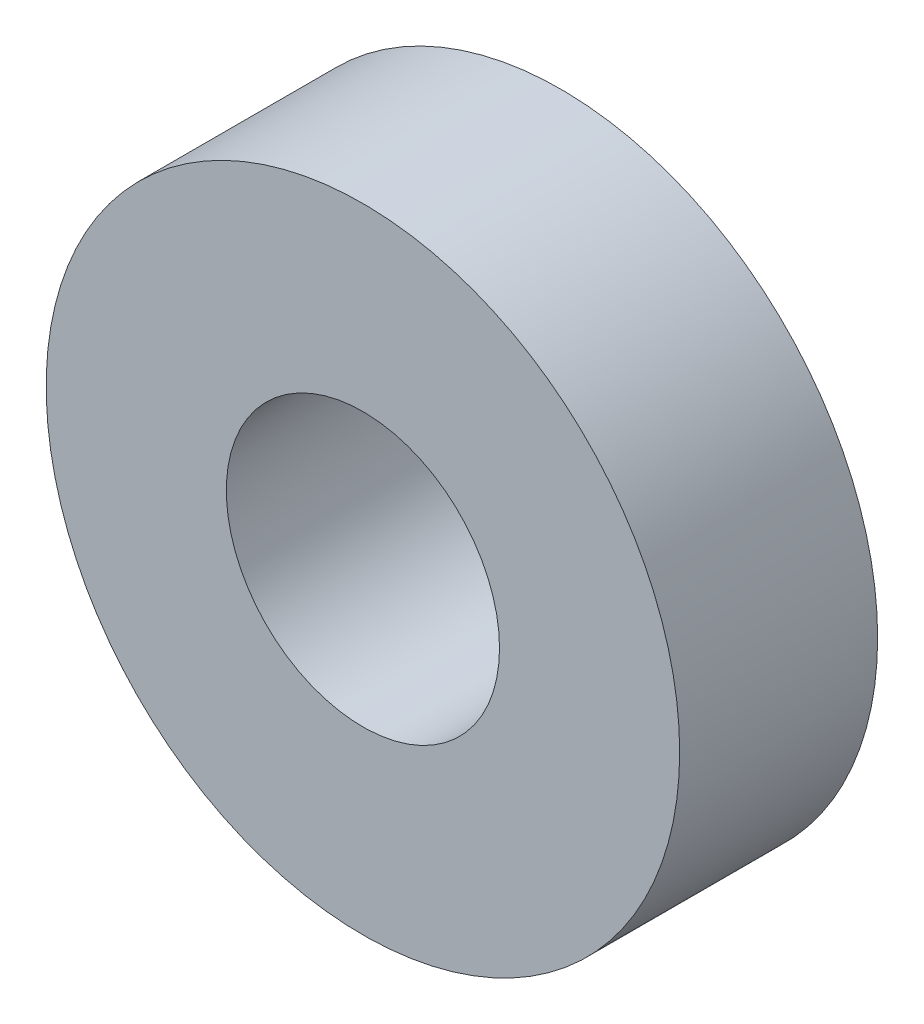
ISO-10303-21;
HEADER;
FILE_DESCRIPTION(('STEP AP214'),'2;1');
FILE_NAME('part.step','',(''),(''),'','','');
FILE_SCHEMA(('AUTOMOTIVE_DESIGN { 1 0 10303 214 1 1 1 1 }'));
ENDSEC;
DATA;
#1=APPLICATION_CONTEXT('core data for automotive mechanical design processes');
#2=APPLICATION_PROTOCOL_DEFINITION('international standard','automotive_design',2000,#1);
#3=PRODUCT_CONTEXT('',#1,'mechanical');
#4=PRODUCT('Part','Part','',(#3));
#5=PRODUCT_RELATED_PRODUCT_CATEGORY('part','',(#4));
#6=PRODUCT_DEFINITION_FORMATION('','',#4);
#7=PRODUCT_DEFINITION_CONTEXT('part definition',#1,'design');
#8=PRODUCT_DEFINITION('design','',#6,#7);
#9=PRODUCT_DEFINITION_SHAPE('','',#8);
#10=(LENGTH_UNIT() NAMED_UNIT(*) SI_UNIT(.MILLI.,.METRE.));
#11=(NAMED_UNIT(*) PLANE_ANGLE_UNIT() SI_UNIT($,.RADIAN.));
#12=(NAMED_UNIT(*) SI_UNIT($,.STERADIAN.) SOLID_ANGLE_UNIT());
#13=UNCERTAINTY_MEASURE_WITH_UNIT(LENGTH_MEASURE(1.E-05),#10,'distance_accuracy_value','');
#14=(GEOMETRIC_REPRESENTATION_CONTEXT(3) GLOBAL_UNCERTAINTY_ASSIGNED_CONTEXT((#13)) GLOBAL_UNIT_ASSIGNED_CONTEXT((#10,
#11,#12)) REPRESENTATION_CONTEXT('',''));
#15=CARTESIAN_POINT('',(0.,0.,0.));
#16=DIRECTION('',(0.,0.,1.));
#17=DIRECTION('',(1.,0.,0.));
#18=AXIS2_PLACEMENT_3D('',#15,#16,#17);
#19=CARTESIAN_POINT('',(0.,0.,2.5));
#20=DIRECTION('',(0.,0.,1.));
#21=DIRECTION('',(1.,0.,0.));
#22=AXIS2_PLACEMENT_3D('',#19,#20,#21);
#23=PLANE('',#22);
#24=CARTESIAN_POINT('',(0.,0.,2.5));
#25=DIRECTION('',(0.,0.,1.));
#26=DIRECTION('',(1.,0.,0.));
#27=AXIS2_PLACEMENT_3D('',#24,#25,#26);
#28=CIRCLE('',#27,4.);
#29=CARTESIAN_POINT('',(4.,0.,2.5));
#30=VERTEX_POINT('',#29);
#31=EDGE_CURVE('E10',#30,#30,#28,.T.);
#32=ORIENTED_EDGE('',*,*,#31,.T.);
#33=EDGE_LOOP('',(#32));
#34=FACE_BOUND('',#33,.T.);
#35=CARTESIAN_POINT('',(0.,0.,2.5));
#36=DIRECTION('',(0.,0.,1.));
#37=DIRECTION('',(1.,0.,0.));
#38=AXIS2_PLACEMENT_3D('',#35,#36,#37);
#39=CIRCLE('',#38,1.725);
#40=CARTESIAN_POINT('',(1.725,0.,2.5));
#41=VERTEX_POINT('',#40);
#42=EDGE_CURVE('E42',#41,#41,#39,.T.);
#43=ORIENTED_EDGE('',*,*,#42,.F.);
#44=EDGE_LOOP('',(#43));
#45=FACE_BOUND('',#44,.T.);
#46=ADVANCED_FACE('F31',(#34,#45),#23,.T.);
#47=CARTESIAN_POINT('',(0.,0.,0.));
#48=DIRECTION('',(0.,0.,1.));
#49=DIRECTION('',(1.,0.,0.));
#50=AXIS2_PLACEMENT_3D('',#47,#48,#49);
#51=PLANE('',#50);
#52=CARTESIAN_POINT('',(0.,0.,0.));
#53=DIRECTION('',(0.,0.,1.));
#54=DIRECTION('',(1.,0.,0.));
#55=AXIS2_PLACEMENT_3D('',#52,#53,#54);
#56=CIRCLE('',#55,4.);
#57=CARTESIAN_POINT('',(4.,0.,0.));
#58=VERTEX_POINT('',#57);
#59=EDGE_CURVE('E35',#58,#58,#56,.T.);
#60=ORIENTED_EDGE('',*,*,#59,.F.);
#61=EDGE_LOOP('',(#60));
#62=FACE_BOUND('',#61,.T.);
#63=CARTESIAN_POINT('',(0.,0.,0.));
#64=DIRECTION('',(0.,0.,1.));
#65=DIRECTION('',(1.,0.,0.));
#66=AXIS2_PLACEMENT_3D('',#63,#64,#65);
#67=CIRCLE('',#66,1.725);
#68=CARTESIAN_POINT('',(1.725,0.,0.));
#69=VERTEX_POINT('',#68);
#70=EDGE_CURVE('E44',#69,#69,#67,.T.);
#71=ORIENTED_EDGE('',*,*,#70,.T.);
#72=EDGE_LOOP('',(#71));
#73=FACE_BOUND('',#72,.T.);
#74=ADVANCED_FACE('F54',(#62,#73),#51,.F.);
#75=CARTESIAN_POINT('',(0.,0.,2.5));
#76=DIRECTION('',(0.,0.,-1.));
#77=DIRECTION('',(-1.,0.,0.));
#78=AXIS2_PLACEMENT_3D('',#75,#76,#77);
#79=CYLINDRICAL_SURFACE('',#78,4.);
#80=ORIENTED_EDGE('',*,*,#31,.F.);
#81=EDGE_LOOP('',(#80));
#82=FACE_BOUND('',#81,.T.);
#83=ORIENTED_EDGE('',*,*,#59,.T.);
#84=EDGE_LOOP('',(#83));
#85=FACE_BOUND('',#84,.T.);
#86=ADVANCED_FACE('F33',(#82,#85),#79,.T.);
#87=CARTESIAN_POINT('',(0.,0.,2.5));
#88=DIRECTION('',(0.,0.,-1.));
#89=DIRECTION('',(-1.,0.,0.));
#90=AXIS2_PLACEMENT_3D('',#87,#88,#89);
#91=CYLINDRICAL_SURFACE('',#90,1.725);
#92=ORIENTED_EDGE('',*,*,#42,.T.);
#93=EDGE_LOOP('',(#92));
#94=FACE_BOUND('',#93,.T.);
#95=ORIENTED_EDGE('',*,*,#70,.F.);
#96=EDGE_LOOP('',(#95));
#97=FACE_BOUND('',#96,.T.);
#98=ADVANCED_FACE('F50',(#94,#97),#91,.F.);
#99=CLOSED_SHELL('',(#46,#74,#86,#98));
#100=MANIFOLD_SOLID_BREP('B2',#99);
#101=ADVANCED_BREP_SHAPE_REPRESENTATION('',(#18,#100),#14);
#102=SHAPE_DEFINITION_REPRESENTATION(#9,#101);
ENDSEC;
END-ISO-10303-21;
